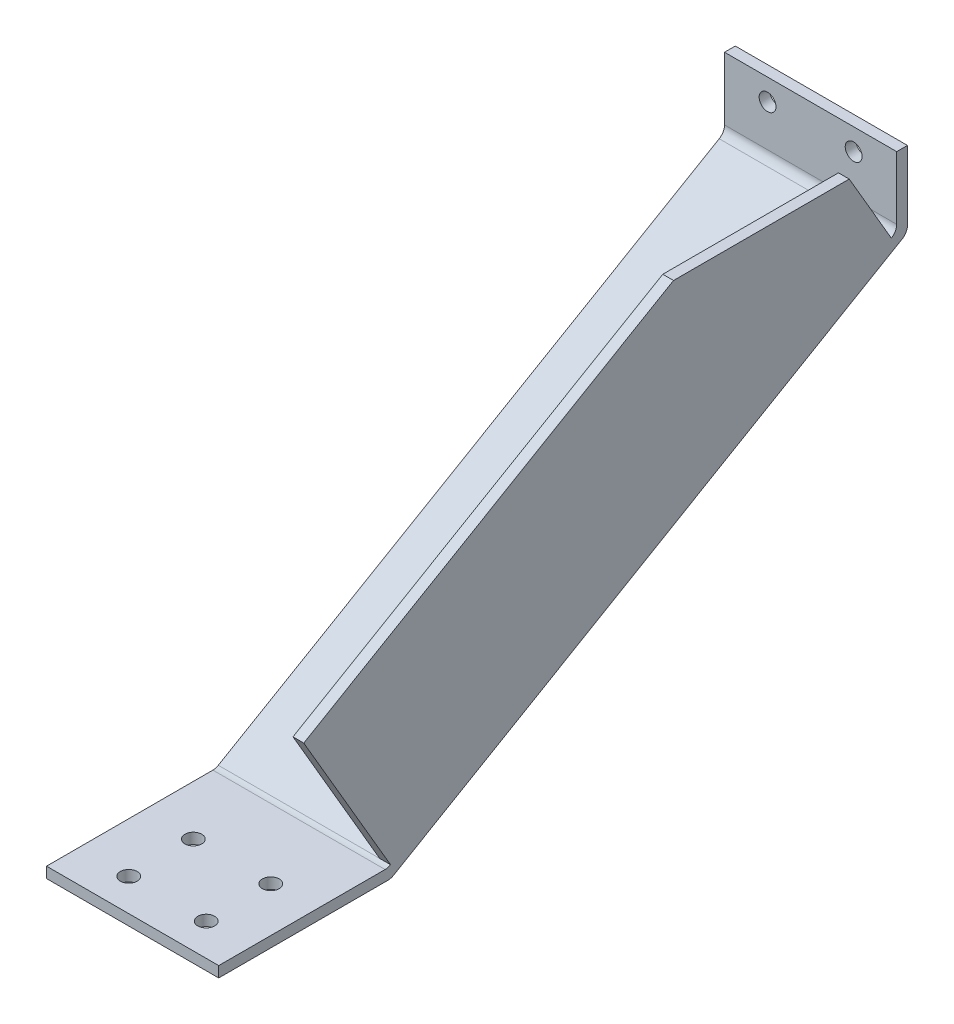
ISO-10303-21;
HEADER;
FILE_DESCRIPTION(('STEP AP214'),'2;1');
FILE_NAME('part.step','',(''),(''),'','','');
FILE_SCHEMA(('AUTOMOTIVE_DESIGN { 1 0 10303 214 1 1 1 1 }'));
ENDSEC;
DATA;
#1=APPLICATION_CONTEXT('core data for automotive mechanical design processes');
#2=APPLICATION_PROTOCOL_DEFINITION('international standard','automotive_design',2000,#1);
#3=PRODUCT_CONTEXT('',#1,'mechanical');
#4=PRODUCT('Part','Part','',(#3));
#5=PRODUCT_RELATED_PRODUCT_CATEGORY('part','',(#4));
#6=PRODUCT_DEFINITION_FORMATION('','',#4);
#7=PRODUCT_DEFINITION_CONTEXT('part definition',#1,'design');
#8=PRODUCT_DEFINITION('design','',#6,#7);
#9=PRODUCT_DEFINITION_SHAPE('','',#8);
#10=(LENGTH_UNIT() NAMED_UNIT(*) SI_UNIT(.MILLI.,.METRE.));
#11=(NAMED_UNIT(*) PLANE_ANGLE_UNIT() SI_UNIT($,.RADIAN.));
#12=(NAMED_UNIT(*) SI_UNIT($,.STERADIAN.) SOLID_ANGLE_UNIT());
#13=UNCERTAINTY_MEASURE_WITH_UNIT(LENGTH_MEASURE(1.E-05),#10,'distance_accuracy_value','');
#14=(GEOMETRIC_REPRESENTATION_CONTEXT(3) GLOBAL_UNCERTAINTY_ASSIGNED_CONTEXT((#13)) GLOBAL_UNIT_ASSIGNED_CONTEXT((#10,
#11,#12)) REPRESENTATION_CONTEXT('',''));
#15=CARTESIAN_POINT('',(0.,0.,0.));
#16=DIRECTION('',(0.,0.,1.));
#17=DIRECTION('',(1.,0.,0.));
#18=AXIS2_PLACEMENT_3D('',#15,#16,#17);
#19=CARTESIAN_POINT('',(38.1,104.775,0.927499998937));
#20=DIRECTION('',(0.,0.,1.));
#21=DIRECTION('',(1.,0.,0.));
#22=AXIS2_PLACEMENT_3D('',#19,#20,#21);
#23=CYLINDRICAL_SURFACE('',#22,2.4892);
#24=CARTESIAN_POINT('',(38.1,104.775,3.175));
#25=DIRECTION('',(0.,0.,1.));
#26=DIRECTION('',(1.,0.,0.));
#27=AXIS2_PLACEMENT_3D('',#24,#25,#26);
#28=CIRCLE('',#27,2.4892);
#29=CARTESIAN_POINT('',(40.5892,104.775,3.175));
#30=VERTEX_POINT('',#29);
#31=EDGE_CURVE('E267',#30,#30,#28,.T.);
#32=ORIENTED_EDGE('',*,*,#31,.T.);
#33=EDGE_LOOP('',(#32));
#34=FACE_BOUND('',#33,.T.);
#35=CARTESIAN_POINT('',(38.1,104.775,0.));
#36=DIRECTION('',(0.,0.,1.));
#37=DIRECTION('',(1.,0.,0.));
#38=AXIS2_PLACEMENT_3D('',#35,#36,#37);
#39=CIRCLE('',#38,2.4892);
#40=CARTESIAN_POINT('',(40.5892,104.775,0.));
#41=VERTEX_POINT('',#40);
#42=EDGE_CURVE('E272',#41,#41,#39,.F.);
#43=ORIENTED_EDGE('',*,*,#42,.T.);
#44=EDGE_LOOP('',(#43));
#45=FACE_BOUND('',#44,.T.);
#46=ADVANCED_FACE('F17',(#34,#45),#23,.F.);
#47=CARTESIAN_POINT('',(12.7,104.775,0.927499998937));
#48=DIRECTION('',(0.,0.,1.));
#49=DIRECTION('',(1.,0.,0.));
#50=AXIS2_PLACEMENT_3D('',#47,#48,#49);
#51=CYLINDRICAL_SURFACE('',#50,2.4892);
#52=CARTESIAN_POINT('',(12.7,104.775,3.175));
#53=DIRECTION('',(0.,0.,1.));
#54=DIRECTION('',(1.,0.,0.));
#55=AXIS2_PLACEMENT_3D('',#52,#53,#54);
#56=CIRCLE('',#55,2.4892);
#57=CARTESIAN_POINT('',(15.1892,104.775,3.175));
#58=VERTEX_POINT('',#57);
#59=EDGE_CURVE('E264',#58,#58,#56,.T.);
#60=ORIENTED_EDGE('',*,*,#59,.T.);
#61=EDGE_LOOP('',(#60));
#62=FACE_BOUND('',#61,.T.);
#63=CARTESIAN_POINT('',(12.7,104.775,0.));
#64=DIRECTION('',(0.,0.,1.));
#65=DIRECTION('',(1.,0.,0.));
#66=AXIS2_PLACEMENT_3D('',#63,#64,#65);
#67=CIRCLE('',#66,2.4892);
#68=CARTESIAN_POINT('',(15.1892,104.775,0.));
#69=VERTEX_POINT('',#68);
#70=EDGE_CURVE('E222',#69,#69,#67,.F.);
#71=ORIENTED_EDGE('',*,*,#70,.T.);
#72=EDGE_LOOP('',(#71));
#73=FACE_BOUND('',#72,.T.);
#74=ADVANCED_FACE('F463',(#62,#73),#51,.F.);
#75=CARTESIAN_POINT('',(0.,3.175,153.258358524));
#76=DIRECTION('',(0.,-0.863778900898361,-0.503871025524211));
#77=DIRECTION('',(0.,0.503871025524211,-0.863778900898361));
#78=AXIS2_PLACEMENT_3D('',#75,#76,#77);
#79=PLANE('',#78);
#80=DIRECTION('',(1.,0.,0.));
#81=VECTOR('',#80,1.);
#82=CARTESIAN_POINT('',(25.4,89.8047536007359,4.75020949398092));
#83=LINE('',#82,#81);
#84=CARTESIAN_POINT('',(47.625,89.8047536007211,4.75020949394443));
#85=VERTEX_POINT('',#84);
#86=CARTESIAN_POINT('',(0.,89.8047536007225,4.75020949396264));
#87=VERTEX_POINT('',#86);
#88=EDGE_CURVE('E206',#85,#87,#83,.F.);
#89=ORIENTED_EDGE('',*,*,#88,.T.);
#90=DIRECTION('',(0.,-0.503871025522749,0.863778900899214));
#91=VECTOR('',#90,1.);
#92=CARTESIAN_POINT('',(0.,89.8047536007,4.75020949396));
#93=LINE('',#92,#91);
#94=CARTESIAN_POINT('',(0.,3.6075019896475,152.516926541983));
#95=VERTEX_POINT('',#94);
#96=EDGE_CURVE('E169',#87,#95,#93,.T.);
#97=ORIENTED_EDGE('',*,*,#96,.T.);
#98=DIRECTION('',(1.,0.,0.));
#99=VECTOR('',#98,1.);
#100=CARTESIAN_POINT('',(25.4,3.60750198963116,152.516926541989));
#101=LINE('',#100,#99);
#102=CARTESIAN_POINT('',(47.625,3.60750198985399,152.516926541639));
#103=VERTEX_POINT('',#102);
#104=EDGE_CURVE('E179',#95,#103,#101,.T.);
#105=ORIENTED_EDGE('',*,*,#104,.T.);
#106=DIRECTION('',(0.,0.503871025522749,-0.863778900899214));
#107=VECTOR('',#106,1.);
#108=CARTESIAN_POINT('',(47.625,3.60750198965,152.516926542));
#109=LINE('',#108,#107);
#110=EDGE_CURVE('E181',#103,#85,#109,.T.);
#111=ORIENTED_EDGE('',*,*,#110,.T.);
#112=EDGE_LOOP('',(#89,#97,#105,#111));
#113=FACE_BOUND('',#112,.T.);
#114=ADVANCED_FACE('F460',(#113),#79,.F.);
#115=CARTESIAN_POINT('',(47.625,0.,0.));
#116=DIRECTION('',(1.,0.,0.));
#117=DIRECTION('',(0.,0.,-1.));
#118=AXIS2_PLACEMENT_3D('',#115,#116,#117);
#119=PLANE('',#118);
#120=DIRECTION('',(0.,-0.863778900898361,-0.503871025524211));
#121=VECTOR('',#120,1.);
#122=CARTESIAN_POINT('',(47.625,0.865003979295,150.917136035));
#123=LINE('',#122,#121);
#124=CARTESIAN_POINT('',(47.625,47.4874701553933,178.11357463784));
#125=VERTEX_POINT('',#124);
#126=EDGE_CURVE('E184',#125,#103,#123,.T.);
#127=ORIENTED_EDGE('',*,*,#126,.F.);
#128=DIRECTION('',(0.,-0.503871025524211,0.863778900898361));
#129=VECTOR('',#128,1.);
#130=CARTESIAN_POINT('',(47.625,47.4874701553,178.113574638));
#131=LINE('',#130,#129);
#132=CARTESIAN_POINT('',(47.625,111.124999999981,69.0206663328838));
#133=VERTEX_POINT('',#132);
#134=EDGE_CURVE('E192',#133,#125,#131,.T.);
#135=ORIENTED_EDGE('',*,*,#134,.F.);
#136=DIRECTION('',(0.,0.,-1.));
#137=VECTOR('',#136,1.);
#138=CARTESIAN_POINT('',(47.625,111.125,3.175));
#139=LINE('',#138,#137);
#140=CARTESIAN_POINT('',(47.625,111.125,17.1870198935));
#141=VERTEX_POINT('',#140);
#142=EDGE_CURVE('E195',#133,#141,#139,.T.);
#143=ORIENTED_EDGE('',*,*,#142,.T.);
#144=DIRECTION('',(0.,0.863778900898361,0.503871025524211));
#145=VECTOR('',#144,1.);
#146=CARTESIAN_POINT('',(47.625,111.125,17.1870198935));
#147=LINE('',#146,#145);
#148=EDGE_CURVE('E203',#85,#141,#147,.T.);
#149=ORIENTED_EDGE('',*,*,#148,.F.);
#150=ORIENTED_EDGE('',*,*,#110,.F.);
#151=EDGE_LOOP('',(#127,#135,#143,#149,#150));
#152=FACE_BOUND('',#151,.T.);
#153=ADVANCED_FACE('F457',(#152),#119,.F.);
#154=CARTESIAN_POINT('',(25.4,6.35,154.116717048));
#155=DIRECTION('',(1.,0.,0.));
#156=DIRECTION('',(0.,0.,-1.));
#157=AXIS2_PLACEMENT_3D('',#154,#155,#156);
#158=CYLINDRICAL_SURFACE('',#157,3.175);
#159=CARTESIAN_POINT('',(50.8,6.35,154.116717048));
#160=DIRECTION('',(1.,0.,0.));
#161=DIRECTION('',(0.,0.,-1.));
#162=AXIS2_PLACEMENT_3D('',#159,#160,#161);
#163=CIRCLE('',#162,3.175);
#164=CARTESIAN_POINT('',(50.8,3.60750198984928,152.516926541637));
#165=VERTEX_POINT('',#164);
#166=CARTESIAN_POINT('',(50.8,3.175,154.116717048));
#167=VERTEX_POINT('',#166);
#168=EDGE_CURVE('E20',#165,#167,#163,.F.);
#169=ORIENTED_EDGE('',*,*,#168,.F.);
#170=DIRECTION('',(1.,0.,0.));
#171=VECTOR('',#170,1.);
#172=CARTESIAN_POINT('',(50.8,3.6075019900674,152.516926541284));
#173=LINE('',#172,#171);
#174=EDGE_CURVE('E176',#103,#165,#173,.T.);
#175=ORIENTED_EDGE('',*,*,#174,.F.);
#176=ORIENTED_EDGE('',*,*,#104,.F.);
#177=CARTESIAN_POINT('',(0.,6.35,154.116717048));
#178=DIRECTION('',(1.,0.,0.));
#179=DIRECTION('',(0.,0.,-1.));
#180=AXIS2_PLACEMENT_3D('',#177,#178,#179);
#181=CIRCLE('',#180,3.175);
#182=CARTESIAN_POINT('',(0.,3.175,154.116717048));
#183=VERTEX_POINT('',#182);
#184=EDGE_CURVE('E171',#95,#183,#181,.F.);
#185=ORIENTED_EDGE('',*,*,#184,.T.);
#186=DIRECTION('',(1.,0.,0.));
#187=VECTOR('',#186,1.);
#188=CARTESIAN_POINT('',(0.,3.175,154.116717048));
#189=LINE('',#188,#187);
#190=EDGE_CURVE('E175',#183,#167,#189,.T.);
#191=ORIENTED_EDGE('',*,*,#190,.T.);
#192=EDGE_LOOP('',(#169,#175,#176,#185,#191));
#193=FACE_BOUND('',#192,.T.);
#194=ADVANCED_FACE('F278',(#193),#158,.F.);
#195=CARTESIAN_POINT('',(0.,0.,0.));
#196=DIRECTION('',(1.,0.,0.));
#197=DIRECTION('',(0.,0.,-1.));
#198=AXIS2_PLACEMENT_3D('',#195,#196,#197);
#199=PLANE('',#198);
#200=DIRECTION('',(0.,0.,1.));
#201=VECTOR('',#200,1.);
#202=CARTESIAN_POINT('',(0.,0.,152.4));
#203=LINE('',#202,#201);
#204=CARTESIAN_POINT('',(0.,0.,153.258358524));
#205=VERTEX_POINT('',#204);
#206=CARTESIAN_POINT('',(0.,0.,203.2));
#207=VERTEX_POINT('',#206);
#208=EDGE_CURVE('E157',#205,#207,#203,.T.);
#209=ORIENTED_EDGE('',*,*,#208,.T.);
#210=DIRECTION('',(0.,1.,0.));
#211=VECTOR('',#210,1.);
#212=CARTESIAN_POINT('',(0.,0.,203.2));
#213=LINE('',#212,#211);
#214=CARTESIAN_POINT('',(0.,3.175,203.2));
#215=VERTEX_POINT('',#214);
#216=EDGE_CURVE('E163',#207,#215,#213,.T.);
#217=ORIENTED_EDGE('',*,*,#216,.T.);
#218=DIRECTION('',(0.,0.,-1.));
#219=VECTOR('',#218,1.);
#220=CARTESIAN_POINT('',(0.,3.175,203.2));
#221=LINE('',#220,#219);
#222=EDGE_CURVE('E172',#215,#183,#221,.T.);
#223=ORIENTED_EDGE('',*,*,#222,.T.);
#224=ORIENTED_EDGE('',*,*,#184,.F.);
#225=ORIENTED_EDGE('',*,*,#96,.F.);
#226=CARTESIAN_POINT('',(0.,92.5472516111,6.35));
#227=DIRECTION('',(1.,0.,0.));
#228=DIRECTION('',(0.,0.,-1.));
#229=AXIS2_PLACEMENT_3D('',#226,#227,#228);
#230=CIRCLE('',#229,3.175);
#231=CARTESIAN_POINT('',(0.,92.5472516111,3.175));
#232=VERTEX_POINT('',#231);
#233=EDGE_CURVE('E262',#87,#232,#230,.T.);
#234=ORIENTED_EDGE('',*,*,#233,.T.);
#235=DIRECTION('',(0.,1.,0.));
#236=VECTOR('',#235,1.);
#237=CARTESIAN_POINT('',(0.,90.7236258055,3.175));
#238=LINE('',#237,#236);
#239=CARTESIAN_POINT('',(0.,111.125,3.175));
#240=VERTEX_POINT('',#239);
#241=EDGE_CURVE('E214',#232,#240,#238,.T.);
#242=ORIENTED_EDGE('',*,*,#241,.T.);
#243=DIRECTION('',(0.,0.,-1.));
#244=VECTOR('',#243,1.);
#245=CARTESIAN_POINT('',(0.,111.125,3.175));
#246=LINE('',#245,#244);
#247=CARTESIAN_POINT('',(0.,111.125,0.));
#248=VERTEX_POINT('',#247);
#249=EDGE_CURVE('E220',#240,#248,#246,.T.);
#250=ORIENTED_EDGE('',*,*,#249,.T.);
#251=DIRECTION('',(0.,1.,0.));
#252=VECTOR('',#251,1.);
#253=CARTESIAN_POINT('',(0.,111.125,0.));
#254=LINE('',#253,#252);
#255=CARTESIAN_POINT('',(0.,90.7236258055,0.));
#256=VERTEX_POINT('',#255);
#257=EDGE_CURVE('E225',#248,#256,#254,.F.);
#258=ORIENTED_EDGE('',*,*,#257,.T.);
#259=CARTESIAN_POINT('',(0.,90.7236258055,3.175));
#260=DIRECTION('',(1.,0.,0.));
#261=DIRECTION('',(0.,0.,-1.));
#262=AXIS2_PLACEMENT_3D('',#259,#260,#261);
#263=CIRCLE('',#262,3.175);
#264=CARTESIAN_POINT('',(0.,87.98112779517,1.57520949395807));
#265=VERTEX_POINT('',#264);
#266=EDGE_CURVE('E138',#265,#256,#263,.T.);
#267=ORIENTED_EDGE('',*,*,#266,.F.);
#268=DIRECTION('',(0.,-0.503871025524211,0.863778900898361));
#269=VECTOR('',#268,1.);
#270=CARTESIAN_POINT('',(0.,88.9,0.));
#271=LINE('',#270,#269);
#272=CARTESIAN_POINT('',(0.,0.432501989524129,151.658568017908));
#273=VERTEX_POINT('',#272);
#274=EDGE_CURVE('E132',#265,#273,#271,.T.);
#275=ORIENTED_EDGE('',*,*,#274,.T.);
#276=CARTESIAN_POINT('',(0.,3.175,153.258358524));
#277=DIRECTION('',(1.,0.,0.));
#278=DIRECTION('',(0.,0.,-1.));
#279=AXIS2_PLACEMENT_3D('',#276,#277,#278);
#280=CIRCLE('',#279,3.175);
#281=EDGE_CURVE('E136',#205,#273,#280,.T.);
#282=ORIENTED_EDGE('',*,*,#281,.F.);
#283=EDGE_LOOP('',(#209,#217,#223,#224,#225,#234,#242,#250,#258,#267,#275,#282));
#284=FACE_BOUND('',#283,.T.);
#285=ADVANCED_FACE('F135',(#284),#199,.F.);
#286=CARTESIAN_POINT('',(25.4,3.175,153.258358524));
#287=DIRECTION('',(1.,0.,0.));
#288=DIRECTION('',(0.,0.,-1.));
#289=AXIS2_PLACEMENT_3D('',#286,#287,#288);
#290=CYLINDRICAL_SURFACE('',#289,3.175);
#291=ORIENTED_EDGE('',*,*,#281,.T.);
#292=DIRECTION('',(1.,0.,0.));
#293=VECTOR('',#292,1.);
#294=CARTESIAN_POINT('',(0.,0.432501989515457,151.658568017923));
#295=LINE('',#294,#293);
#296=CARTESIAN_POINT('',(50.8,0.432501989589229,151.658568017948));
#297=VERTEX_POINT('',#296);
#298=EDGE_CURVE('E142',#273,#297,#295,.T.);
#299=ORIENTED_EDGE('',*,*,#298,.T.);
#300=CARTESIAN_POINT('',(50.8,3.175,153.258358524));
#301=DIRECTION('',(1.,0.,0.));
#302=DIRECTION('',(0.,0.,-1.));
#303=AXIS2_PLACEMENT_3D('',#300,#301,#302);
#304=CIRCLE('',#303,3.175);
#305=CARTESIAN_POINT('',(50.8,0.,153.258358524));
#306=VERTEX_POINT('',#305);
#307=EDGE_CURVE('E35',#297,#306,#304,.F.);
#308=ORIENTED_EDGE('',*,*,#307,.T.);
#309=DIRECTION('',(1.,0.,0.));
#310=VECTOR('',#309,1.);
#311=CARTESIAN_POINT('',(0.,0.,153.258358524));
#312=LINE('',#311,#310);
#313=EDGE_CURVE('E146',#306,#205,#312,.F.);
#314=ORIENTED_EDGE('',*,*,#313,.T.);
#315=EDGE_LOOP('',(#291,#299,#308,#314));
#316=FACE_BOUND('',#315,.T.);
#317=ADVANCED_FACE('F144',(#316),#290,.T.);
#318=CARTESIAN_POINT('',(14.732,0.927499999398,193.675));
#319=DIRECTION('',(0.,1.,0.));
#320=DIRECTION('',(0.,0.,1.));
#321=AXIS2_PLACEMENT_3D('',#318,#319,#320);
#322=CYLINDRICAL_SURFACE('',#321,2.4892);
#323=CARTESIAN_POINT('',(14.732,3.175,193.675));
#324=DIRECTION('',(0.,1.,0.));
#325=DIRECTION('',(0.,0.,1.));
#326=AXIS2_PLACEMENT_3D('',#323,#324,#325);
#327=CIRCLE('',#326,2.4892);
#328=CARTESIAN_POINT('',(14.732,3.175,196.1642));
#329=VERTEX_POINT('',#328);
#330=EDGE_CURVE('E259',#329,#329,#327,.T.);
#331=ORIENTED_EDGE('',*,*,#330,.T.);
#332=EDGE_LOOP('',(#331));
#333=FACE_BOUND('',#332,.T.);
#334=CARTESIAN_POINT('',(14.732,0.,193.675));
#335=DIRECTION('',(0.,1.,0.));
#336=DIRECTION('',(0.,0.,1.));
#337=AXIS2_PLACEMENT_3D('',#334,#335,#336);
#338=CIRCLE('',#337,2.4892);
#339=CARTESIAN_POINT('',(14.732,0.,196.1642));
#340=VERTEX_POINT('',#339);
#341=EDGE_CURVE('E248',#340,#340,#338,.F.);
#342=ORIENTED_EDGE('',*,*,#341,.T.);
#343=EDGE_LOOP('',(#342));
#344=FACE_BOUND('',#343,.T.);
#345=ADVANCED_FACE('F435',(#333,#344),#322,.F.);
#346=CARTESIAN_POINT('',(37.592,0.927499999398,193.675));
#347=DIRECTION('',(0.,1.,0.));
#348=DIRECTION('',(0.,0.,1.));
#349=AXIS2_PLACEMENT_3D('',#346,#347,#348);
#350=CYLINDRICAL_SURFACE('',#349,2.4892);
#351=CARTESIAN_POINT('',(37.592,3.175,193.675));
#352=DIRECTION('',(0.,1.,0.));
#353=DIRECTION('',(0.,0.,1.));
#354=AXIS2_PLACEMENT_3D('',#351,#352,#353);
#355=CIRCLE('',#354,2.4892);
#356=CARTESIAN_POINT('',(37.592,3.175,196.1642));
#357=VERTEX_POINT('',#356);
#358=EDGE_CURVE('E256',#357,#357,#355,.T.);
#359=ORIENTED_EDGE('',*,*,#358,.T.);
#360=EDGE_LOOP('',(#359));
#361=FACE_BOUND('',#360,.T.);
#362=CARTESIAN_POINT('',(37.592,0.,193.675));
#363=DIRECTION('',(0.,1.,0.));
#364=DIRECTION('',(0.,0.,1.));
#365=AXIS2_PLACEMENT_3D('',#362,#363,#364);
#366=CIRCLE('',#365,2.4892);
#367=CARTESIAN_POINT('',(37.592,0.,196.1642));
#368=VERTEX_POINT('',#367);
#369=EDGE_CURVE('E245',#368,#368,#366,.F.);
#370=ORIENTED_EDGE('',*,*,#369,.T.);
#371=EDGE_LOOP('',(#370));
#372=FACE_BOUND('',#371,.T.);
#373=ADVANCED_FACE('F438',(#361,#372),#350,.F.);
#374=CARTESIAN_POINT('',(37.592,0.927499999398,174.625));
#375=DIRECTION('',(0.,1.,0.));
#376=DIRECTION('',(0.,0.,1.));
#377=AXIS2_PLACEMENT_3D('',#374,#375,#376);
#378=CYLINDRICAL_SURFACE('',#377,2.4892);
#379=CARTESIAN_POINT('',(37.592,3.175,174.625));
#380=DIRECTION('',(0.,1.,0.));
#381=DIRECTION('',(0.,0.,1.));
#382=AXIS2_PLACEMENT_3D('',#379,#380,#381);
#383=CIRCLE('',#382,2.4892);
#384=CARTESIAN_POINT('',(37.592,3.175,177.1142));
#385=VERTEX_POINT('',#384);
#386=EDGE_CURVE('E253',#385,#385,#383,.T.);
#387=ORIENTED_EDGE('',*,*,#386,.T.);
#388=EDGE_LOOP('',(#387));
#389=FACE_BOUND('',#388,.T.);
#390=CARTESIAN_POINT('',(37.592,0.,174.625));
#391=DIRECTION('',(0.,1.,0.));
#392=DIRECTION('',(0.,0.,1.));
#393=AXIS2_PLACEMENT_3D('',#390,#391,#392);
#394=CIRCLE('',#393,2.4892);
#395=CARTESIAN_POINT('',(37.592,0.,177.1142));
#396=VERTEX_POINT('',#395);
#397=EDGE_CURVE('E242',#396,#396,#394,.F.);
#398=ORIENTED_EDGE('',*,*,#397,.T.);
#399=EDGE_LOOP('',(#398));
#400=FACE_BOUND('',#399,.T.);
#401=ADVANCED_FACE('F447',(#389,#400),#378,.F.);
#402=CARTESIAN_POINT('',(14.732,0.927499999398,174.625));
#403=DIRECTION('',(0.,1.,0.));
#404=DIRECTION('',(0.,0.,1.));
#405=AXIS2_PLACEMENT_3D('',#402,#403,#404);
#406=CYLINDRICAL_SURFACE('',#405,2.4892);
#407=CARTESIAN_POINT('',(14.732,3.175,174.625));
#408=DIRECTION('',(0.,1.,0.));
#409=DIRECTION('',(0.,0.,1.));
#410=AXIS2_PLACEMENT_3D('',#407,#408,#409);
#411=CIRCLE('',#410,2.4892);
#412=CARTESIAN_POINT('',(14.732,3.175,177.1142));
#413=VERTEX_POINT('',#412);
#414=EDGE_CURVE('E166',#413,#413,#411,.T.);
#415=ORIENTED_EDGE('',*,*,#414,.T.);
#416=EDGE_LOOP('',(#415));
#417=FACE_BOUND('',#416,.T.);
#418=CARTESIAN_POINT('',(14.732,0.,174.625));
#419=DIRECTION('',(0.,1.,0.));
#420=DIRECTION('',(0.,0.,1.));
#421=AXIS2_PLACEMENT_3D('',#418,#419,#420);
#422=CIRCLE('',#421,2.4892);
#423=CARTESIAN_POINT('',(14.732,0.,177.1142));
#424=VERTEX_POINT('',#423);
#425=EDGE_CURVE('E239',#424,#424,#422,.F.);
#426=ORIENTED_EDGE('',*,*,#425,.T.);
#427=EDGE_LOOP('',(#426));
#428=FACE_BOUND('',#427,.T.);
#429=ADVANCED_FACE('F492',(#417,#428),#406,.F.);
#430=CARTESIAN_POINT('',(0.,88.9,0.));
#431=DIRECTION('',(0.,0.863778900898361,0.503871025524211));
#432=DIRECTION('',(0.,-0.503871025524211,0.863778900898361));
#433=AXIS2_PLACEMENT_3D('',#430,#431,#432);
#434=PLANE('',#433);
#435=ORIENTED_EDGE('',*,*,#274,.F.);
#436=DIRECTION('',(1.,0.,0.));
#437=VECTOR('',#436,1.);
#438=CARTESIAN_POINT('',(25.4,87.9811277951613,1.5752094939374));
#439=LINE('',#438,#437);
#440=CARTESIAN_POINT('',(50.8,87.9811277951732,1.57520949396144));
#441=VERTEX_POINT('',#440);
#442=EDGE_CURVE('E152',#441,#265,#439,.F.);
#443=ORIENTED_EDGE('',*,*,#442,.F.);
#444=DIRECTION('',(0.,0.503871025523498,-0.863778900898777));
#445=VECTOR('',#444,1.);
#446=CARTESIAN_POINT('',(50.8,0.432501989647,151.658568018));
#447=LINE('',#446,#445);
#448=EDGE_CURVE('E151',#297,#441,#447,.T.);
#449=ORIENTED_EDGE('',*,*,#448,.F.);
#450=ORIENTED_EDGE('',*,*,#298,.F.);
#451=EDGE_LOOP('',(#435,#443,#449,#450));
#452=FACE_BOUND('',#451,.T.);
#453=ADVANCED_FACE('F149',(#452),#434,.F.);
#454=CARTESIAN_POINT('',(25.4,90.7236258055,3.175));
#455=DIRECTION('',(1.,0.,0.));
#456=DIRECTION('',(0.,0.,-1.));
#457=AXIS2_PLACEMENT_3D('',#454,#455,#456);
#458=CYLINDRICAL_SURFACE('',#457,3.175);
#459=ORIENTED_EDGE('',*,*,#266,.T.);
#460=DIRECTION('',(1.,0.,0.));
#461=VECTOR('',#460,1.);
#462=CARTESIAN_POINT('',(0.,90.7236258055,0.));
#463=LINE('',#462,#461);
#464=CARTESIAN_POINT('',(50.8,90.7236258055,0.));
#465=VERTEX_POINT('',#464);
#466=EDGE_CURVE('E227',#256,#465,#463,.T.);
#467=ORIENTED_EDGE('',*,*,#466,.T.);
#468=CARTESIAN_POINT('',(50.8,90.7236258055,3.175));
#469=DIRECTION('',(1.,0.,0.));
#470=DIRECTION('',(0.,0.,-1.));
#471=AXIS2_PLACEMENT_3D('',#468,#469,#470);
#472=CIRCLE('',#471,3.175);
#473=EDGE_CURVE('E235',#441,#465,#472,.T.);
#474=ORIENTED_EDGE('',*,*,#473,.F.);
#475=ORIENTED_EDGE('',*,*,#442,.T.);
#476=EDGE_LOOP('',(#459,#467,#474,#475));
#477=FACE_BOUND('',#476,.T.);
#478=ADVANCED_FACE('F337',(#477),#458,.T.);
#479=CARTESIAN_POINT('',(0.,111.125,0.));
#480=DIRECTION('',(0.,0.,1.));
#481=DIRECTION('',(1.,0.,0.));
#482=AXIS2_PLACEMENT_3D('',#479,#480,#481);
#483=PLANE('',#482);
#484=ORIENTED_EDGE('',*,*,#70,.F.);
#485=EDGE_LOOP('',(#484));
#486=FACE_BOUND('',#485,.T.);
#487=ORIENTED_EDGE('',*,*,#42,.F.);
#488=EDGE_LOOP('',(#487));
#489=FACE_BOUND('',#488,.T.);
#490=ORIENTED_EDGE('',*,*,#257,.F.);
#491=DIRECTION('',(1.,0.,0.));
#492=VECTOR('',#491,1.);
#493=CARTESIAN_POINT('',(0.,111.125,0.));
#494=LINE('',#493,#492);
#495=CARTESIAN_POINT('',(50.8,111.125,0.));
#496=VERTEX_POINT('',#495);
#497=EDGE_CURVE('E217',#248,#496,#494,.T.);
#498=ORIENTED_EDGE('',*,*,#497,.T.);
#499=DIRECTION('',(0.,1.,0.));
#500=VECTOR('',#499,1.);
#501=CARTESIAN_POINT('',(50.8,0.,0.));
#502=LINE('',#501,#500);
#503=EDGE_CURVE('E238',#465,#496,#502,.T.);
#504=ORIENTED_EDGE('',*,*,#503,.F.);
#505=ORIENTED_EDGE('',*,*,#466,.F.);
#506=EDGE_LOOP('',(#490,#498,#504,#505));
#507=FACE_BOUND('',#506,.T.);
#508=ADVANCED_FACE('F341',(#486,#489,#507),#483,.F.);
#509=CARTESIAN_POINT('',(0.,111.125,3.175));
#510=DIRECTION('',(0.,-1.,0.));
#511=DIRECTION('',(0.,0.,-1.));
#512=AXIS2_PLACEMENT_3D('',#509,#510,#511);
#513=PLANE('',#512);
#514=ORIENTED_EDGE('',*,*,#249,.F.);
#515=DIRECTION('',(-1.,0.,0.));
#516=VECTOR('',#515,1.);
#517=CARTESIAN_POINT('',(0.,111.125,3.175));
#518=LINE('',#517,#516);
#519=CARTESIAN_POINT('',(50.8,111.125,3.175));
#520=VERTEX_POINT('',#519);
#521=EDGE_CURVE('E216',#240,#520,#518,.F.);
#522=ORIENTED_EDGE('',*,*,#521,.T.);
#523=DIRECTION('',(0.,0.,-1.));
#524=VECTOR('',#523,1.);
#525=CARTESIAN_POINT('',(50.8,111.125,0.));
#526=LINE('',#525,#524);
#527=EDGE_CURVE('E326',#496,#520,#526,.F.);
#528=ORIENTED_EDGE('',*,*,#527,.F.);
#529=ORIENTED_EDGE('',*,*,#497,.F.);
#530=EDGE_LOOP('',(#514,#522,#528,#529));
#531=FACE_BOUND('',#530,.T.);
#532=ADVANCED_FACE('F477',(#531),#513,.F.);
#533=CARTESIAN_POINT('',(0.,90.7236258055,3.175));
#534=DIRECTION('',(0.,0.,-1.));
#535=DIRECTION('',(-1.,0.,0.));
#536=AXIS2_PLACEMENT_3D('',#533,#534,#535);
#537=PLANE('',#536);
#538=ORIENTED_EDGE('',*,*,#59,.F.);
#539=EDGE_LOOP('',(#538));
#540=FACE_BOUND('',#539,.T.);
#541=ORIENTED_EDGE('',*,*,#31,.F.);
#542=EDGE_LOOP('',(#541));
#543=FACE_BOUND('',#542,.T.);
#544=DIRECTION('',(0.,1.,0.));
#545=VECTOR('',#544,1.);
#546=CARTESIAN_POINT('',(50.8,0.,3.175));
#547=LINE('',#546,#545);
#548=CARTESIAN_POINT('',(50.8,92.5472516111,3.175));
#549=VERTEX_POINT('',#548);
#550=EDGE_CURVE('E234',#520,#549,#547,.F.);
#551=ORIENTED_EDGE('',*,*,#550,.F.);
#552=ORIENTED_EDGE('',*,*,#521,.F.);
#553=ORIENTED_EDGE('',*,*,#241,.F.);
#554=DIRECTION('',(1.,0.,0.));
#555=VECTOR('',#554,1.);
#556=CARTESIAN_POINT('',(25.4,92.5472516111,3.175));
#557=LINE('',#556,#555);
#558=EDGE_CURVE('E211',#232,#549,#557,.T.);
#559=ORIENTED_EDGE('',*,*,#558,.T.);
#560=EDGE_LOOP('',(#551,#552,#553,#559));
#561=FACE_BOUND('',#560,.T.);
#562=ADVANCED_FACE('F385',(#540,#543,#561),#537,.F.);
#563=CARTESIAN_POINT('',(25.4,92.5472516111,6.35));
#564=DIRECTION('',(1.,0.,0.));
#565=DIRECTION('',(0.,0.,-1.));
#566=AXIS2_PLACEMENT_3D('',#563,#564,#565);
#567=CYLINDRICAL_SURFACE('',#566,3.175);
#568=DIRECTION('',(1.,0.,0.));
#569=VECTOR('',#568,1.);
#570=CARTESIAN_POINT('',(50.8,89.8047536007243,4.75020949391838));
#571=LINE('',#570,#569);
#572=CARTESIAN_POINT('',(50.8,89.8047536007301,4.75020949394965));
#573=VERTEX_POINT('',#572);
#574=EDGE_CURVE('E205',#573,#85,#571,.F.);
#575=ORIENTED_EDGE('',*,*,#574,.F.);
#576=CARTESIAN_POINT('',(50.8,92.5472516111,6.35));
#577=DIRECTION('',(1.,0.,0.));
#578=DIRECTION('',(0.,0.,-1.));
#579=AXIS2_PLACEMENT_3D('',#576,#577,#578);
#580=CIRCLE('',#579,3.175);
#581=EDGE_CURVE('E230',#549,#573,#580,.F.);
#582=ORIENTED_EDGE('',*,*,#581,.F.);
#583=ORIENTED_EDGE('',*,*,#558,.F.);
#584=ORIENTED_EDGE('',*,*,#233,.F.);
#585=ORIENTED_EDGE('',*,*,#88,.F.);
#586=EDGE_LOOP('',(#575,#582,#583,#584,#585));
#587=FACE_BOUND('',#586,.T.);
#588=ADVANCED_FACE('F390',(#587),#567,.F.);
#589=CARTESIAN_POINT('',(50.8,111.125,17.1870198935));
#590=DIRECTION('',(0.,0.503871025524211,-0.863778900898361));
#591=DIRECTION('',(0.,0.863778900898361,0.503871025524211));
#592=AXIS2_PLACEMENT_3D('',#589,#590,#591);
#593=PLANE('',#592);
#594=DIRECTION('',(0.,0.863778900899344,0.503871025522524));
#595=VECTOR('',#594,1.);
#596=CARTESIAN_POINT('',(50.8,89.8047536007,4.75020949396));
#597=LINE('',#596,#595);
#598=CARTESIAN_POINT('',(50.8,111.125,17.1870198935));
#599=VERTEX_POINT('',#598);
#600=EDGE_CURVE('E233',#573,#599,#597,.T.);
#601=ORIENTED_EDGE('',*,*,#600,.F.);
#602=ORIENTED_EDGE('',*,*,#574,.T.);
#603=ORIENTED_EDGE('',*,*,#148,.T.);
#604=DIRECTION('',(1.,0.,0.));
#605=VECTOR('',#604,1.);
#606=CARTESIAN_POINT('',(0.,111.125,17.1870198935));
#607=LINE('',#606,#605);
#608=EDGE_CURVE('E200',#141,#599,#607,.T.);
#609=ORIENTED_EDGE('',*,*,#608,.T.);
#610=EDGE_LOOP('',(#601,#602,#603,#609));
#611=FACE_BOUND('',#610,.T.);
#612=ADVANCED_FACE('F394',(#611),#593,.T.);
#613=CARTESIAN_POINT('',(0.,111.125,3.175));
#614=DIRECTION('',(0.,-1.,0.));
#615=DIRECTION('',(0.,0.,-1.));
#616=AXIS2_PLACEMENT_3D('',#613,#614,#615);
#617=PLANE('',#616);
#618=DIRECTION('',(1.,0.,0.));
#619=VECTOR('',#618,1.);
#620=CARTESIAN_POINT('',(50.8,111.124999999972,69.0206663328838));
#621=LINE('',#620,#619);
#622=CARTESIAN_POINT('',(50.8,111.124999999991,69.0206663328946));
#623=VERTEX_POINT('',#622);
#624=EDGE_CURVE('E194',#623,#133,#621,.F.);
#625=ORIENTED_EDGE('',*,*,#624,.F.);
#626=DIRECTION('',(0.,0.,-1.));
#627=VECTOR('',#626,1.);
#628=CARTESIAN_POINT('',(50.8,111.125,0.));
#629=LINE('',#628,#627);
#630=EDGE_CURVE('E304',#599,#623,#629,.F.);
#631=ORIENTED_EDGE('',*,*,#630,.F.);
#632=ORIENTED_EDGE('',*,*,#608,.F.);
#633=ORIENTED_EDGE('',*,*,#142,.F.);
#634=EDGE_LOOP('',(#625,#631,#632,#633));
#635=FACE_BOUND('',#634,.T.);
#636=ADVANCED_FACE('F398',(#635),#617,.F.);
#637=CARTESIAN_POINT('',(50.8,47.4874701553,178.113574638));
#638=DIRECTION('',(0.,0.863778900898361,0.503871025524211));
#639=DIRECTION('',(0.,-0.503871025524211,0.863778900898361));
#640=AXIS2_PLACEMENT_3D('',#637,#638,#639);
#641=PLANE('',#640);
#642=DIRECTION('',(0.,-0.503871025524431,0.863778900898232));
#643=VECTOR('',#642,1.);
#644=CARTESIAN_POINT('',(50.8,111.125,69.0206663329));
#645=LINE('',#644,#643);
#646=CARTESIAN_POINT('',(50.8,47.4874701553466,178.11357463792));
#647=VERTEX_POINT('',#646);
#648=EDGE_CURVE('E300',#623,#647,#645,.T.);
#649=ORIENTED_EDGE('',*,*,#648,.F.);
#650=ORIENTED_EDGE('',*,*,#624,.T.);
#651=ORIENTED_EDGE('',*,*,#134,.T.);
#652=DIRECTION('',(1.,0.,0.));
#653=VECTOR('',#652,1.);
#654=CARTESIAN_POINT('',(50.8,47.4874701554399,178.11357463776));
#655=LINE('',#654,#653);
#656=EDGE_CURVE('E67',#647,#125,#655,.F.);
#657=ORIENTED_EDGE('',*,*,#656,.F.);
#658=EDGE_LOOP('',(#649,#650,#651,#657));
#659=FACE_BOUND('',#658,.T.);
#660=ADVANCED_FACE('F400',(#659),#641,.T.);
#661=CARTESIAN_POINT('',(50.8,0.865003979295,150.917136035));
#662=DIRECTION('',(0.,-0.503871025524211,0.863778900898361));
#663=DIRECTION('',(0.,-0.863778900898361,-0.503871025524211));
#664=AXIS2_PLACEMENT_3D('',#661,#662,#663);
#665=PLANE('',#664);
#666=ORIENTED_EDGE('',*,*,#126,.T.);
#667=ORIENTED_EDGE('',*,*,#174,.T.);
#668=DIRECTION('',(0.,-0.863778900903824,-0.503871025514845));
#669=VECTOR('',#668,1.);
#670=CARTESIAN_POINT('',(50.8,47.4874701553,178.113574638));
#671=LINE('',#670,#669);
#672=EDGE_CURVE('E303',#647,#165,#671,.T.);
#673=ORIENTED_EDGE('',*,*,#672,.F.);
#674=ORIENTED_EDGE('',*,*,#656,.T.);
#675=EDGE_LOOP('',(#666,#667,#673,#674));
#676=FACE_BOUND('',#675,.T.);
#677=ADVANCED_FACE('F402',(#676),#665,.T.);
#678=CARTESIAN_POINT('',(0.,3.175,203.2));
#679=DIRECTION('',(0.,-1.,0.));
#680=DIRECTION('',(0.,0.,-1.));
#681=AXIS2_PLACEMENT_3D('',#678,#679,#680);
#682=PLANE('',#681);
#683=ORIENTED_EDGE('',*,*,#414,.F.);
#684=EDGE_LOOP('',(#683));
#685=FACE_BOUND('',#684,.T.);
#686=ORIENTED_EDGE('',*,*,#386,.F.);
#687=EDGE_LOOP('',(#686));
#688=FACE_BOUND('',#687,.T.);
#689=ORIENTED_EDGE('',*,*,#358,.F.);
#690=EDGE_LOOP('',(#689));
#691=FACE_BOUND('',#690,.T.);
#692=ORIENTED_EDGE('',*,*,#330,.F.);
#693=EDGE_LOOP('',(#692));
#694=FACE_BOUND('',#693,.T.);
#695=ORIENTED_EDGE('',*,*,#222,.F.);
#696=DIRECTION('',(-1.,0.,0.));
#697=VECTOR('',#696,1.);
#698=CARTESIAN_POINT('',(0.,3.175,203.2));
#699=LINE('',#698,#697);
#700=CARTESIAN_POINT('',(50.8,3.175,203.2));
#701=VERTEX_POINT('',#700);
#702=EDGE_CURVE('E160',#215,#701,#699,.F.);
#703=ORIENTED_EDGE('',*,*,#702,.T.);
#704=DIRECTION('',(0.,0.,-1.));
#705=VECTOR('',#704,1.);
#706=CARTESIAN_POINT('',(50.8,3.175,0.));
#707=LINE('',#706,#705);
#708=EDGE_CURVE('E288',#167,#701,#707,.F.);
#709=ORIENTED_EDGE('',*,*,#708,.F.);
#710=ORIENTED_EDGE('',*,*,#190,.F.);
#711=EDGE_LOOP('',(#695,#703,#709,#710));
#712=FACE_BOUND('',#711,.T.);
#713=ADVANCED_FACE('F286',(#685,#688,#691,#694,#712),#682,.F.);
#714=CARTESIAN_POINT('',(0.,0.,203.2));
#715=DIRECTION('',(0.,0.,-1.));
#716=DIRECTION('',(-1.,0.,0.));
#717=AXIS2_PLACEMENT_3D('',#714,#715,#716);
#718=PLANE('',#717);
#719=ORIENTED_EDGE('',*,*,#216,.F.);
#720=DIRECTION('',(1.,0.,0.));
#721=VECTOR('',#720,1.);
#722=CARTESIAN_POINT('',(0.,0.,203.2));
#723=LINE('',#722,#721);
#724=CARTESIAN_POINT('',(50.8,0.,203.2));
#725=VERTEX_POINT('',#724);
#726=EDGE_CURVE('E159',#207,#725,#723,.T.);
#727=ORIENTED_EDGE('',*,*,#726,.T.);
#728=DIRECTION('',(0.,1.,0.));
#729=VECTOR('',#728,1.);
#730=CARTESIAN_POINT('',(50.8,0.,203.2));
#731=LINE('',#730,#729);
#732=EDGE_CURVE('E26',#701,#725,#731,.F.);
#733=ORIENTED_EDGE('',*,*,#732,.F.);
#734=ORIENTED_EDGE('',*,*,#702,.F.);
#735=EDGE_LOOP('',(#719,#727,#733,#734));
#736=FACE_BOUND('',#735,.T.);
#737=ADVANCED_FACE('F361',(#736),#718,.F.);
#738=CARTESIAN_POINT('',(0.,0.,152.4));
#739=DIRECTION('',(0.,1.,0.));
#740=DIRECTION('',(0.,0.,1.));
#741=AXIS2_PLACEMENT_3D('',#738,#739,#740);
#742=PLANE('',#741);
#743=ORIENTED_EDGE('',*,*,#425,.F.);
#744=EDGE_LOOP('',(#743));
#745=FACE_BOUND('',#744,.T.);
#746=ORIENTED_EDGE('',*,*,#397,.F.);
#747=EDGE_LOOP('',(#746));
#748=FACE_BOUND('',#747,.T.);
#749=ORIENTED_EDGE('',*,*,#369,.F.);
#750=EDGE_LOOP('',(#749));
#751=FACE_BOUND('',#750,.T.);
#752=ORIENTED_EDGE('',*,*,#341,.F.);
#753=EDGE_LOOP('',(#752));
#754=FACE_BOUND('',#753,.T.);
#755=DIRECTION('',(0.,0.,-1.));
#756=VECTOR('',#755,1.);
#757=CARTESIAN_POINT('',(50.8,0.,0.));
#758=LINE('',#757,#756);
#759=EDGE_CURVE('E11',#725,#306,#758,.T.);
#760=ORIENTED_EDGE('',*,*,#759,.F.);
#761=ORIENTED_EDGE('',*,*,#726,.F.);
#762=ORIENTED_EDGE('',*,*,#208,.F.);
#763=ORIENTED_EDGE('',*,*,#313,.F.);
#764=EDGE_LOOP('',(#760,#761,#762,#763));
#765=FACE_BOUND('',#764,.T.);
#766=ADVANCED_FACE('F413',(#745,#748,#751,#754,#765),#742,.F.);
#767=CARTESIAN_POINT('',(50.8,0.,0.));
#768=DIRECTION('',(1.,0.,0.));
#769=DIRECTION('',(0.,0.,-1.));
#770=AXIS2_PLACEMENT_3D('',#767,#768,#769);
#771=PLANE('',#770);
#772=ORIENTED_EDGE('',*,*,#759,.T.);
#773=ORIENTED_EDGE('',*,*,#307,.F.);
#774=ORIENTED_EDGE('',*,*,#448,.T.);
#775=ORIENTED_EDGE('',*,*,#473,.T.);
#776=ORIENTED_EDGE('',*,*,#503,.T.);
#777=ORIENTED_EDGE('',*,*,#527,.T.);
#778=ORIENTED_EDGE('',*,*,#550,.T.);
#779=ORIENTED_EDGE('',*,*,#581,.T.);
#780=ORIENTED_EDGE('',*,*,#600,.T.);
#781=ORIENTED_EDGE('',*,*,#630,.T.);
#782=ORIENTED_EDGE('',*,*,#648,.T.);
#783=ORIENTED_EDGE('',*,*,#672,.T.);
#784=ORIENTED_EDGE('',*,*,#168,.T.);
#785=ORIENTED_EDGE('',*,*,#708,.T.);
#786=ORIENTED_EDGE('',*,*,#732,.T.);
#787=EDGE_LOOP('',(#772,#773,#774,#775,#776,#777,#778,#779,#780,#781,#782,#783,#784,#785,#786));
#788=FACE_BOUND('',#787,.T.);
#789=ADVANCED_FACE('F346',(#788),#771,.T.);
#790=CLOSED_SHELL('',(#46,#74,#114,#153,#194,#285,#317,#345,#373,#401,#429,#453,#478,#508,#532,
#562,#588,#612,#636,#660,#677,#713,#737,#766,#789));
#791=MANIFOLD_SOLID_BREP('B1',#790);
#792=ADVANCED_BREP_SHAPE_REPRESENTATION('',(#18,#791),#14);
#793=SHAPE_DEFINITION_REPRESENTATION(#9,#792);
ENDSEC;
END-ISO-10303-21;
